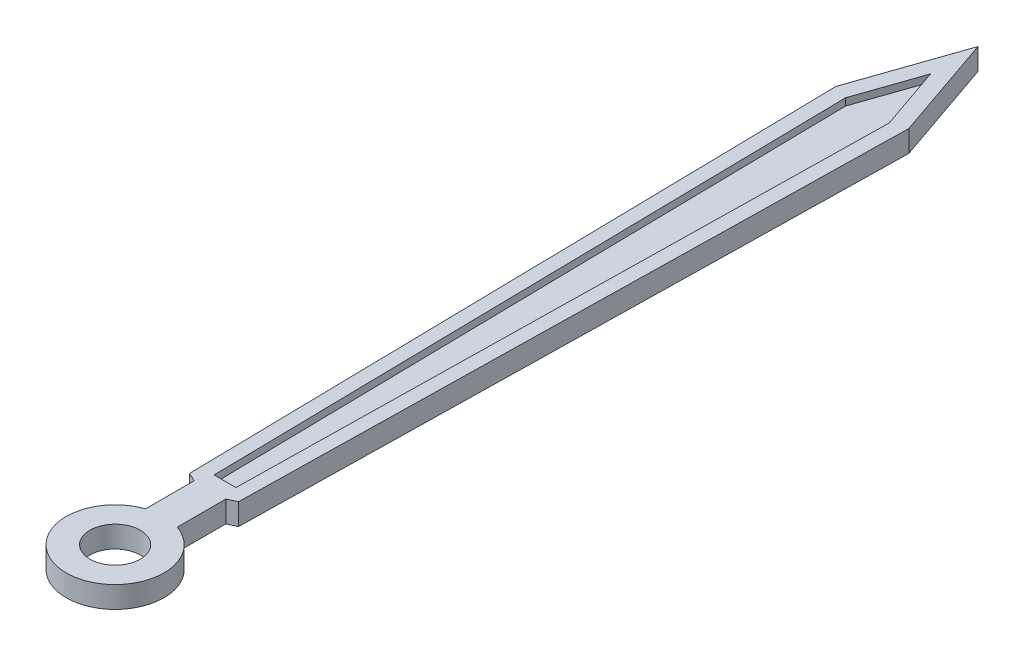
ISO-10303-21;
HEADER;
FILE_DESCRIPTION(('STEP AP214'),'2;1');
FILE_NAME('part.step','',(''),(''),'','','');
FILE_SCHEMA(('AUTOMOTIVE_DESIGN { 1 0 10303 214 1 1 1 1 }'));
ENDSEC;
DATA;
#1=APPLICATION_CONTEXT('core data for automotive mechanical design processes');
#2=APPLICATION_PROTOCOL_DEFINITION('international standard','automotive_design',2000,#1);
#3=PRODUCT_CONTEXT('',#1,'mechanical');
#4=PRODUCT('Part','Part','',(#3));
#5=PRODUCT_RELATED_PRODUCT_CATEGORY('part','',(#4));
#6=PRODUCT_DEFINITION_FORMATION('','',#4);
#7=PRODUCT_DEFINITION_CONTEXT('part definition',#1,'design');
#8=PRODUCT_DEFINITION('design','',#6,#7);
#9=PRODUCT_DEFINITION_SHAPE('','',#8);
#10=(LENGTH_UNIT() NAMED_UNIT(*) SI_UNIT(.MILLI.,.METRE.));
#11=(NAMED_UNIT(*) PLANE_ANGLE_UNIT() SI_UNIT($,.RADIAN.));
#12=(NAMED_UNIT(*) SI_UNIT($,.STERADIAN.) SOLID_ANGLE_UNIT());
#13=UNCERTAINTY_MEASURE_WITH_UNIT(LENGTH_MEASURE(1.E-05),#10,'distance_accuracy_value','');
#14=(GEOMETRIC_REPRESENTATION_CONTEXT(3) GLOBAL_UNCERTAINTY_ASSIGNED_CONTEXT((#13)) GLOBAL_UNIT_ASSIGNED_CONTEXT((#10,
#11,#12)) REPRESENTATION_CONTEXT('',''));
#15=CARTESIAN_POINT('',(0.,0.,0.));
#16=DIRECTION('',(0.,0.,1.));
#17=DIRECTION('',(1.,0.,0.));
#18=AXIS2_PLACEMENT_3D('',#15,#16,#17);
#19=CARTESIAN_POINT('',(0.,0.3,-12.));
#20=DIRECTION('',(-0.945291258367472,0.,0.326227584446873));
#21=DIRECTION('',(0.326227584446873,0.,0.945291258367472));
#22=AXIS2_PLACEMENT_3D('',#19,#20,#21);
#23=PLANE('',#22);
#24=DIRECTION('',(-0.326227584446873,0.,-0.945291258367472));
#25=VECTOR('',#24,1.);
#26=CARTESIAN_POINT('',(0.,0.,-12.));
#27=LINE('',#26,#25);
#28=CARTESIAN_POINT('',(0.507155701636799,0.,-10.5304435484775));
#29=VERTEX_POINT('',#28);
#30=CARTESIAN_POINT('',(0.,0.,-12.));
#31=VERTEX_POINT('',#30);
#32=EDGE_CURVE('E147',#29,#31,#27,.T.);
#33=ORIENTED_EDGE('',*,*,#32,.T.);
#34=DIRECTION('',(0.,-1.,0.));
#35=VECTOR('',#34,1.);
#36=CARTESIAN_POINT('',(0.,0.3,-12.));
#37=LINE('',#36,#35);
#38=CARTESIAN_POINT('',(0.,0.3,-12.));
#39=VERTEX_POINT('',#38);
#40=EDGE_CURVE('E11',#39,#31,#37,.T.);
#41=ORIENTED_EDGE('',*,*,#40,.F.);
#42=DIRECTION('',(-0.326227584446873,0.,-0.945291258367472));
#43=VECTOR('',#42,1.);
#44=CARTESIAN_POINT('',(0.,0.3,-12.));
#45=LINE('',#44,#43);
#46=CARTESIAN_POINT('',(0.507155701636799,0.3,-10.5304435484775));
#47=VERTEX_POINT('',#46);
#48=EDGE_CURVE('E165',#47,#39,#45,.T.);
#49=ORIENTED_EDGE('',*,*,#48,.F.);
#50=DIRECTION('',(0.,-1.,0.));
#51=VECTOR('',#50,1.);
#52=CARTESIAN_POINT('',(0.507155701636799,0.3,-10.5304435484775));
#53=LINE('',#52,#51);
#54=EDGE_CURVE('E143',#47,#29,#53,.T.);
#55=ORIENTED_EDGE('',*,*,#54,.T.);
#56=EDGE_LOOP('',(#33,#41,#49,#55));
#57=FACE_BOUND('',#56,.T.);
#58=ADVANCED_FACE('F33',(#57),#23,.F.);
#59=CARTESIAN_POINT('',(-0.507155701636799,0.3,-10.5304435484775));
#60=DIRECTION('',(0.945291258367472,0.,0.326227584446873));
#61=DIRECTION('',(0.326227584446873,0.,-0.945291258367472));
#62=AXIS2_PLACEMENT_3D('',#59,#60,#61);
#63=PLANE('',#62);
#64=DIRECTION('',(-0.326227584446873,0.,0.945291258367472));
#65=VECTOR('',#64,1.);
#66=CARTESIAN_POINT('',(-0.507155701636799,0.,-10.5304435484775));
#67=LINE('',#66,#65);
#68=CARTESIAN_POINT('',(-0.507155701636799,0.,-10.5304435484775));
#69=VERTEX_POINT('',#68);
#70=EDGE_CURVE('E150',#31,#69,#67,.T.);
#71=ORIENTED_EDGE('',*,*,#70,.T.);
#72=DIRECTION('',(0.,-1.,0.));
#73=VECTOR('',#72,1.);
#74=CARTESIAN_POINT('',(-0.507155701636799,0.3,-10.5304435484775));
#75=LINE('',#74,#73);
#76=CARTESIAN_POINT('',(-0.507155701636799,0.3,-10.5304435484775));
#77=VERTEX_POINT('',#76);
#78=EDGE_CURVE('E40',#77,#69,#75,.T.);
#79=ORIENTED_EDGE('',*,*,#78,.F.);
#80=DIRECTION('',(-0.326227584446873,0.,0.945291258367472));
#81=VECTOR('',#80,1.);
#82=CARTESIAN_POINT('',(-0.507155701636799,0.3,-10.5304435484775));
#83=LINE('',#82,#81);
#84=EDGE_CURVE('E100',#39,#77,#83,.T.);
#85=ORIENTED_EDGE('',*,*,#84,.F.);
#86=ORIENTED_EDGE('',*,*,#40,.T.);
#87=EDGE_LOOP('',(#71,#79,#85,#86));
#88=FACE_BOUND('',#87,.T.);
#89=ADVANCED_FACE('F300',(#88),#63,.F.);
#90=CARTESIAN_POINT('',(-0.507155701636799,0.3,-10.5304435484775));
#91=DIRECTION('',(0.999834746000162,0.,-0.0181791278886145));
#92=DIRECTION('',(-0.0181791278886146,0.,-0.999834746000163));
#93=AXIS2_PLACEMENT_3D('',#90,#91,#92);
#94=PLANE('',#93);
#95=DIRECTION('',(0.0181791278886146,0.,0.999834746000162));
#96=VECTOR('',#95,1.);
#97=CARTESIAN_POINT('',(-0.507155701636799,0.,-10.5304435484775));
#98=LINE('',#97,#96);
#99=CARTESIAN_POINT('',(-0.340695279600335,0.,-1.37527863596579));
#100=VERTEX_POINT('',#99);
#101=EDGE_CURVE('E153',#69,#100,#98,.T.);
#102=ORIENTED_EDGE('',*,*,#101,.T.);
#103=DIRECTION('',(0.,-1.,0.));
#104=VECTOR('',#103,1.);
#105=CARTESIAN_POINT('',(-0.340695279600335,0.3,-1.37527863596579));
#106=LINE('',#105,#104);
#107=CARTESIAN_POINT('',(-0.340695279600335,0.3,-1.37527863596579));
#108=VERTEX_POINT('',#107);
#109=EDGE_CURVE('E175',#108,#100,#106,.T.);
#110=ORIENTED_EDGE('',*,*,#109,.F.);
#111=DIRECTION('',(0.0181791278886146,0.,0.999834746000162));
#112=VECTOR('',#111,1.);
#113=CARTESIAN_POINT('',(-0.507155701636799,0.3,-10.5304435484775));
#114=LINE('',#113,#112);
#115=EDGE_CURVE('E183',#77,#108,#114,.T.);
#116=ORIENTED_EDGE('',*,*,#115,.F.);
#117=ORIENTED_EDGE('',*,*,#78,.T.);
#118=EDGE_LOOP('',(#102,#110,#116,#117));
#119=FACE_BOUND('',#118,.T.);
#120=ADVANCED_FACE('F181',(#119),#94,.F.);
#121=CARTESIAN_POINT('',(-0.340695279600335,0.3,-1.37527863596579));
#122=DIRECTION('',(0.419058177461745,0.,-0.907959384500452));
#123=DIRECTION('',(-0.907959384500453,0.,-0.419058177461746));
#124=AXIS2_PLACEMENT_3D('',#121,#122,#123);
#125=PLANE('',#124);
#126=DIRECTION('',(0.907959384500452,0.,0.419058177461745));
#127=VECTOR('',#126,1.);
#128=CARTESIAN_POINT('',(-0.340695279600335,0.,-1.37527863596579));
#129=LINE('',#128,#127);
#130=CARTESIAN_POINT('',(-0.220137797393776,0.,-1.31963672110122));
#131=VERTEX_POINT('',#130);
#132=EDGE_CURVE('E155',#100,#131,#129,.T.);
#133=ORIENTED_EDGE('',*,*,#132,.T.);
#134=DIRECTION('',(0.,-1.,0.));
#135=VECTOR('',#134,1.);
#136=CARTESIAN_POINT('',(-0.220137797393776,0.3,-1.31963672110122));
#137=LINE('',#136,#135);
#138=CARTESIAN_POINT('',(-0.220137797393776,0.3,-1.31963672110122));
#139=VERTEX_POINT('',#138);
#140=EDGE_CURVE('E172',#139,#131,#137,.T.);
#141=ORIENTED_EDGE('',*,*,#140,.F.);
#142=DIRECTION('',(0.907959384500452,0.,0.419058177461745));
#143=VECTOR('',#142,1.);
#144=CARTESIAN_POINT('',(-0.340695279600335,0.3,-1.37527863596579));
#145=LINE('',#144,#143);
#146=EDGE_CURVE('E199',#108,#139,#145,.T.);
#147=ORIENTED_EDGE('',*,*,#146,.F.);
#148=ORIENTED_EDGE('',*,*,#109,.T.);
#149=EDGE_LOOP('',(#133,#141,#147,#148));
#150=FACE_BOUND('',#149,.T.);
#151=ADVANCED_FACE('F192',(#150),#125,.F.);
#152=CARTESIAN_POINT('',(-0.220137797393776,0.3,-1.31963672110122));
#153=DIRECTION('',(1.,0.,0.));
#154=DIRECTION('',(0.,0.,-1.));
#155=AXIS2_PLACEMENT_3D('',#152,#153,#154);
#156=PLANE('',#155);
#157=DIRECTION('',(0.,0.,1.));
#158=VECTOR('',#157,1.);
#159=CARTESIAN_POINT('',(-0.220137797393776,0.,-1.31963672110122));
#160=LINE('',#159,#158);
#161=CARTESIAN_POINT('',(-0.220137797393776,0.,-0.643381185735655));
#162=VERTEX_POINT('',#161);
#163=EDGE_CURVE('E157',#131,#162,#160,.T.);
#164=ORIENTED_EDGE('',*,*,#163,.T.);
#165=DIRECTION('',(0.,-1.,0.));
#166=VECTOR('',#165,1.);
#167=CARTESIAN_POINT('',(-0.220137797393776,0.3,-0.643381185735655));
#168=LINE('',#167,#166);
#169=CARTESIAN_POINT('',(-0.220137797393776,0.3,-0.643381185735655));
#170=VERTEX_POINT('',#169);
#171=EDGE_CURVE('E169',#170,#162,#168,.T.);
#172=ORIENTED_EDGE('',*,*,#171,.F.);
#173=DIRECTION('',(0.,0.,1.));
#174=VECTOR('',#173,1.);
#175=CARTESIAN_POINT('',(-0.220137797393776,0.3,-1.31963672110122));
#176=LINE('',#175,#174);
#177=EDGE_CURVE('E198',#139,#170,#176,.T.);
#178=ORIENTED_EDGE('',*,*,#177,.F.);
#179=ORIENTED_EDGE('',*,*,#140,.T.);
#180=EDGE_LOOP('',(#164,#172,#178,#179));
#181=FACE_BOUND('',#180,.T.);
#182=ADVANCED_FACE('F196',(#181),#156,.F.);
#183=CARTESIAN_POINT('',(0.,0.3,0.));
#184=DIRECTION('',(0.,-1.,0.));
#185=DIRECTION('',(0.,0.,-1.));
#186=AXIS2_PLACEMENT_3D('',#183,#184,#185);
#187=CYLINDRICAL_SURFACE('',#186,0.68);
#188=CARTESIAN_POINT('',(0.,0.,0.));
#189=DIRECTION('',(0.,1.,0.));
#190=DIRECTION('',(0.,0.,-1.));
#191=AXIS2_PLACEMENT_3D('',#188,#189,#190);
#192=CIRCLE('',#191,0.68);
#193=CARTESIAN_POINT('',(0.220137797393776,0.,-0.643381185735655));
#194=VERTEX_POINT('',#193);
#195=EDGE_CURVE('E159',#162,#194,#192,.T.);
#196=ORIENTED_EDGE('',*,*,#195,.T.);
#197=DIRECTION('',(0.,-1.,0.));
#198=VECTOR('',#197,1.);
#199=CARTESIAN_POINT('',(0.220137797393776,0.3,-0.643381185735655));
#200=LINE('',#199,#198);
#201=CARTESIAN_POINT('',(0.220137797393776,0.3,-0.643381185735655));
#202=VERTEX_POINT('',#201);
#203=EDGE_CURVE('E138',#202,#194,#200,.T.);
#204=ORIENTED_EDGE('',*,*,#203,.F.);
#205=CARTESIAN_POINT('',(0.,0.3,0.));
#206=DIRECTION('',(0.,1.,0.));
#207=DIRECTION('',(0.,0.,-1.));
#208=AXIS2_PLACEMENT_3D('',#205,#206,#207);
#209=CIRCLE('',#208,0.68);
#210=EDGE_CURVE('E126',#170,#202,#209,.T.);
#211=ORIENTED_EDGE('',*,*,#210,.F.);
#212=ORIENTED_EDGE('',*,*,#171,.T.);
#213=EDGE_LOOP('',(#196,#204,#211,#212));
#214=FACE_BOUND('',#213,.T.);
#215=ADVANCED_FACE('F320',(#214),#187,.T.);
#216=CARTESIAN_POINT('',(0.220137797393776,0.3,-0.643381185735655));
#217=DIRECTION('',(-1.,0.,0.));
#218=DIRECTION('',(0.,0.,1.));
#219=AXIS2_PLACEMENT_3D('',#216,#217,#218);
#220=PLANE('',#219);
#221=DIRECTION('',(0.,0.,-1.));
#222=VECTOR('',#221,1.);
#223=CARTESIAN_POINT('',(0.220137797393776,0.,-0.643381185735655));
#224=LINE('',#223,#222);
#225=CARTESIAN_POINT('',(0.220137797393776,0.,-1.31963672110122));
#226=VERTEX_POINT('',#225);
#227=EDGE_CURVE('E135',#194,#226,#224,.T.);
#228=ORIENTED_EDGE('',*,*,#227,.T.);
#229=DIRECTION('',(0.,-1.,0.));
#230=VECTOR('',#229,1.);
#231=CARTESIAN_POINT('',(0.220137797393776,0.3,-1.31963672110122));
#232=LINE('',#231,#230);
#233=CARTESIAN_POINT('',(0.220137797393776,0.3,-1.31963672110122));
#234=VERTEX_POINT('',#233);
#235=EDGE_CURVE('E132',#234,#226,#232,.T.);
#236=ORIENTED_EDGE('',*,*,#235,.F.);
#237=DIRECTION('',(0.,0.,-1.));
#238=VECTOR('',#237,1.);
#239=CARTESIAN_POINT('',(0.220137797393776,0.3,-0.643381185735655));
#240=LINE('',#239,#238);
#241=EDGE_CURVE('E119',#202,#234,#240,.T.);
#242=ORIENTED_EDGE('',*,*,#241,.F.);
#243=ORIENTED_EDGE('',*,*,#203,.T.);
#244=EDGE_LOOP('',(#228,#236,#242,#243));
#245=FACE_BOUND('',#244,.T.);
#246=ADVANCED_FACE('F133',(#245),#220,.F.);
#247=CARTESIAN_POINT('',(0.340695279600335,0.3,-1.37527863596579));
#248=DIRECTION('',(-0.419058177461745,0.,-0.907959384500452));
#249=DIRECTION('',(-0.907959384500453,0.,0.419058177461746));
#250=AXIS2_PLACEMENT_3D('',#247,#248,#249);
#251=PLANE('',#250);
#252=DIRECTION('',(0.907959384500452,0.,-0.419058177461745));
#253=VECTOR('',#252,1.);
#254=CARTESIAN_POINT('',(0.340695279600335,0.,-1.37527863596579));
#255=LINE('',#254,#253);
#256=CARTESIAN_POINT('',(0.340695279600335,0.,-1.37527863596579));
#257=VERTEX_POINT('',#256);
#258=EDGE_CURVE('E162',#226,#257,#255,.T.);
#259=ORIENTED_EDGE('',*,*,#258,.T.);
#260=DIRECTION('',(0.,-1.,0.));
#261=VECTOR('',#260,1.);
#262=CARTESIAN_POINT('',(0.340695279600335,0.3,-1.37527863596579));
#263=LINE('',#262,#261);
#264=CARTESIAN_POINT('',(0.340695279600335,0.3,-1.37527863596579));
#265=VERTEX_POINT('',#264);
#266=EDGE_CURVE('E139',#265,#257,#263,.T.);
#267=ORIENTED_EDGE('',*,*,#266,.F.);
#268=DIRECTION('',(0.907959384500452,0.,-0.419058177461745));
#269=VECTOR('',#268,1.);
#270=CARTESIAN_POINT('',(0.340695279600335,0.3,-1.37527863596579));
#271=LINE('',#270,#269);
#272=EDGE_CURVE('E123',#234,#265,#271,.T.);
#273=ORIENTED_EDGE('',*,*,#272,.F.);
#274=ORIENTED_EDGE('',*,*,#235,.T.);
#275=EDGE_LOOP('',(#259,#267,#273,#274));
#276=FACE_BOUND('',#275,.T.);
#277=ADVANCED_FACE('F141',(#276),#251,.F.);
#278=CARTESIAN_POINT('',(0.507155701636799,0.3,-10.5304435484775));
#279=DIRECTION('',(-0.999834746000162,0.,-0.0181791278886145));
#280=DIRECTION('',(-0.0181791278886146,0.,0.999834746000163));
#281=AXIS2_PLACEMENT_3D('',#278,#279,#280);
#282=PLANE('',#281);
#283=DIRECTION('',(0.0181791278886146,0.,-0.999834746000162));
#284=VECTOR('',#283,1.);
#285=CARTESIAN_POINT('',(0.507155701636799,0.,-10.5304435484775));
#286=LINE('',#285,#284);
#287=EDGE_CURVE('E92',#257,#29,#286,.T.);
#288=ORIENTED_EDGE('',*,*,#287,.T.);
#289=ORIENTED_EDGE('',*,*,#54,.F.);
#290=DIRECTION('',(0.0181791278886146,0.,-0.999834746000162));
#291=VECTOR('',#290,1.);
#292=CARTESIAN_POINT('',(0.507155701636799,0.3,-10.5304435484775));
#293=LINE('',#292,#291);
#294=EDGE_CURVE('E56',#265,#47,#293,.T.);
#295=ORIENTED_EDGE('',*,*,#294,.F.);
#296=ORIENTED_EDGE('',*,*,#266,.T.);
#297=EDGE_LOOP('',(#288,#289,#295,#296));
#298=FACE_BOUND('',#297,.T.);
#299=ADVANCED_FACE('F307',(#298),#282,.F.);
#300=CARTESIAN_POINT('',(0.,0.3,0.));
#301=DIRECTION('',(0.,-1.,0.));
#302=DIRECTION('',(0.,0.,-1.));
#303=AXIS2_PLACEMENT_3D('',#300,#301,#302);
#304=PLANE('',#303);
#305=DIRECTION('',(0.0170079435781802,0.,0.999855354466456));
#306=VECTOR('',#305,1.);
#307=CARTESIAN_POINT('',(-0.303891547001217,0.3,-10.4602954606957));
#308=LINE('',#307,#306);
#309=CARTESIAN_POINT('',(-0.303891547001217,0.3,-10.4602954606957));
#310=VERTEX_POINT('',#309);
#311=CARTESIAN_POINT('',(-0.151945773500608,0.3,-1.52777551642469));
#312=VERTEX_POINT('',#311);
#313=EDGE_CURVE('E235',#310,#312,#308,.T.);
#314=ORIENTED_EDGE('',*,*,#313,.F.);
#315=DIRECTION('',(-0.326227584446873,0.,0.945291258367472));
#316=VECTOR('',#315,1.);
#317=CARTESIAN_POINT('',(0.,0.3,-11.3408648440575));
#318=LINE('',#317,#316);
#319=CARTESIAN_POINT('',(0.,0.3,-11.3408648440575));
#320=VERTEX_POINT('',#319);
#321=EDGE_CURVE('E47',#320,#310,#318,.T.);
#322=ORIENTED_EDGE('',*,*,#321,.F.);
#323=DIRECTION('',(-0.326227584446873,0.,-0.945291258367472));
#324=VECTOR('',#323,1.);
#325=CARTESIAN_POINT('',(0.,0.3,-11.3408648440575));
#326=LINE('',#325,#324);
#327=CARTESIAN_POINT('',(0.303891547001217,0.3,-10.4602954606957));
#328=VERTEX_POINT('',#327);
#329=EDGE_CURVE('E225',#328,#320,#326,.T.);
#330=ORIENTED_EDGE('',*,*,#329,.F.);
#331=DIRECTION('',(0.0170079435781802,0.,-0.999855354466456));
#332=VECTOR('',#331,1.);
#333=CARTESIAN_POINT('',(0.303891547001217,0.3,-10.4602954606957));
#334=LINE('',#333,#332);
#335=CARTESIAN_POINT('',(0.151945773500608,0.3,-1.52777551642469));
#336=VERTEX_POINT('',#335);
#337=EDGE_CURVE('E229',#336,#328,#334,.T.);
#338=ORIENTED_EDGE('',*,*,#337,.F.);
#339=DIRECTION('',(1.,0.,0.));
#340=VECTOR('',#339,1.);
#341=CARTESIAN_POINT('',(0.151945773500608,0.3,-1.52777551642469));
#342=LINE('',#341,#340);
#343=EDGE_CURVE('E232',#312,#336,#342,.T.);
#344=ORIENTED_EDGE('',*,*,#343,.F.);
#345=EDGE_LOOP('',(#314,#322,#330,#338,#344));
#346=FACE_BOUND('',#345,.T.);
#347=CARTESIAN_POINT('',(0.,0.3,0.));
#348=DIRECTION('',(0.,1.,0.));
#349=DIRECTION('',(0.,0.,1.));
#350=AXIS2_PLACEMENT_3D('',#347,#348,#349);
#351=CIRCLE('',#350,0.35);
#352=CARTESIAN_POINT('',(0.,0.3,0.35));
#353=VERTEX_POINT('',#352);
#354=EDGE_CURVE('E206',#353,#353,#351,.T.);
#355=ORIENTED_EDGE('',*,*,#354,.F.);
#356=EDGE_LOOP('',(#355));
#357=FACE_BOUND('',#356,.T.);
#358=ORIENTED_EDGE('',*,*,#48,.T.);
#359=ORIENTED_EDGE('',*,*,#84,.T.);
#360=ORIENTED_EDGE('',*,*,#115,.T.);
#361=ORIENTED_EDGE('',*,*,#146,.T.);
#362=ORIENTED_EDGE('',*,*,#177,.T.);
#363=ORIENTED_EDGE('',*,*,#210,.T.);
#364=ORIENTED_EDGE('',*,*,#241,.T.);
#365=ORIENTED_EDGE('',*,*,#272,.T.);
#366=ORIENTED_EDGE('',*,*,#294,.T.);
#367=EDGE_LOOP('',(#358,#359,#360,#361,#362,#363,#364,#365,#366));
#368=FACE_BOUND('',#367,.T.);
#369=ADVANCED_FACE('F121',(#346,#357,#368),#304,.F.);
#370=CARTESIAN_POINT('',(0.,0.,0.));
#371=DIRECTION('',(0.,-1.,0.));
#372=DIRECTION('',(0.,0.,-1.));
#373=AXIS2_PLACEMENT_3D('',#370,#371,#372);
#374=PLANE('',#373);
#375=CARTESIAN_POINT('',(0.,0.,0.));
#376=DIRECTION('',(0.,1.,0.));
#377=DIRECTION('',(0.,0.,1.));
#378=AXIS2_PLACEMENT_3D('',#375,#376,#377);
#379=CIRCLE('',#378,0.35);
#380=CARTESIAN_POINT('',(0.,0.,0.35));
#381=VERTEX_POINT('',#380);
#382=EDGE_CURVE('E151',#381,#381,#379,.T.);
#383=ORIENTED_EDGE('',*,*,#382,.T.);
#384=EDGE_LOOP('',(#383));
#385=FACE_BOUND('',#384,.T.);
#386=ORIENTED_EDGE('',*,*,#32,.F.);
#387=ORIENTED_EDGE('',*,*,#287,.F.);
#388=ORIENTED_EDGE('',*,*,#258,.F.);
#389=ORIENTED_EDGE('',*,*,#227,.F.);
#390=ORIENTED_EDGE('',*,*,#195,.F.);
#391=ORIENTED_EDGE('',*,*,#163,.F.);
#392=ORIENTED_EDGE('',*,*,#132,.F.);
#393=ORIENTED_EDGE('',*,*,#101,.F.);
#394=ORIENTED_EDGE('',*,*,#70,.F.);
#395=EDGE_LOOP('',(#386,#387,#388,#389,#390,#391,#392,#393,#394));
#396=FACE_BOUND('',#395,.T.);
#397=ADVANCED_FACE('F187',(#385,#396),#374,.T.);
#398=CARTESIAN_POINT('',(0.,0.,0.));
#399=DIRECTION('',(0.,1.,0.));
#400=DIRECTION('',(0.,0.,1.));
#401=AXIS2_PLACEMENT_3D('',#398,#399,#400);
#402=CYLINDRICAL_SURFACE('',#401,0.35);
#403=ORIENTED_EDGE('',*,*,#382,.F.);
#404=EDGE_LOOP('',(#403));
#405=FACE_BOUND('',#404,.T.);
#406=ORIENTED_EDGE('',*,*,#354,.T.);
#407=EDGE_LOOP('',(#406));
#408=FACE_BOUND('',#407,.T.);
#409=ADVANCED_FACE('F367',(#405,#408),#402,.F.);
#410=CARTESIAN_POINT('',(0.,0.2,-11.3408648440575));
#411=DIRECTION('',(-0.945291258367472,0.,-0.326227584446873));
#412=DIRECTION('',(-0.326227584446873,0.,0.945291258367472));
#413=AXIS2_PLACEMENT_3D('',#410,#411,#412);
#414=PLANE('',#413);
#415=ORIENTED_EDGE('',*,*,#321,.T.);
#416=DIRECTION('',(0.,1.,0.));
#417=VECTOR('',#416,1.);
#418=CARTESIAN_POINT('',(-0.303891547001217,0.2,-10.4602954606957));
#419=LINE('',#418,#417);
#420=CARTESIAN_POINT('',(-0.303891547001217,0.2,-10.4602954606957));
#421=VERTEX_POINT('',#420);
#422=EDGE_CURVE('E212',#421,#310,#419,.T.);
#423=ORIENTED_EDGE('',*,*,#422,.F.);
#424=DIRECTION('',(-0.326227584446873,0.,0.945291258367472));
#425=VECTOR('',#424,1.);
#426=CARTESIAN_POINT('',(0.,0.2,-11.3408648440575));
#427=LINE('',#426,#425);
#428=CARTESIAN_POINT('',(0.,0.2,-11.3408648440575));
#429=VERTEX_POINT('',#428);
#430=EDGE_CURVE('E228',#429,#421,#427,.T.);
#431=ORIENTED_EDGE('',*,*,#430,.F.);
#432=DIRECTION('',(0.,1.,0.));
#433=VECTOR('',#432,1.);
#434=CARTESIAN_POINT('',(0.,0.2,-11.3408648440575));
#435=LINE('',#434,#433);
#436=EDGE_CURVE('E209',#429,#320,#435,.T.);
#437=ORIENTED_EDGE('',*,*,#436,.T.);
#438=EDGE_LOOP('',(#415,#423,#431,#437));
#439=FACE_BOUND('',#438,.T.);
#440=ADVANCED_FACE('F259',(#439),#414,.F.);
#441=CARTESIAN_POINT('',(0.,0.2,-11.3408648440575));
#442=DIRECTION('',(0.945291258367472,0.,-0.326227584446873));
#443=DIRECTION('',(-0.326227584446873,0.,-0.945291258367472));
#444=AXIS2_PLACEMENT_3D('',#441,#442,#443);
#445=PLANE('',#444);
#446=ORIENTED_EDGE('',*,*,#329,.T.);
#447=ORIENTED_EDGE('',*,*,#436,.F.);
#448=DIRECTION('',(-0.326227584446873,0.,-0.945291258367472));
#449=VECTOR('',#448,1.);
#450=CARTESIAN_POINT('',(0.,0.2,-11.3408648440575));
#451=LINE('',#450,#449);
#452=CARTESIAN_POINT('',(0.303891547001217,0.2,-10.4602954606957));
#453=VERTEX_POINT('',#452);
#454=EDGE_CURVE('E215',#453,#429,#451,.T.);
#455=ORIENTED_EDGE('',*,*,#454,.F.);
#456=DIRECTION('',(0.,1.,0.));
#457=VECTOR('',#456,1.);
#458=CARTESIAN_POINT('',(0.303891547001217,0.2,-10.4602954606957));
#459=LINE('',#458,#457);
#460=EDGE_CURVE('E221',#453,#328,#459,.T.);
#461=ORIENTED_EDGE('',*,*,#460,.T.);
#462=EDGE_LOOP('',(#446,#447,#455,#461));
#463=FACE_BOUND('',#462,.T.);
#464=ADVANCED_FACE('F273',(#463),#445,.F.);
#465=CARTESIAN_POINT('',(0.303891547001217,0.2,-10.4602954606957));
#466=DIRECTION('',(0.999855354466455,0.,0.0170079435781802));
#467=DIRECTION('',(0.0170079435781802,0.,-0.999855354466456));
#468=AXIS2_PLACEMENT_3D('',#465,#466,#467);
#469=PLANE('',#468);
#470=ORIENTED_EDGE('',*,*,#337,.T.);
#471=ORIENTED_EDGE('',*,*,#460,.F.);
#472=DIRECTION('',(0.0170079435781802,0.,-0.999855354466456));
#473=VECTOR('',#472,1.);
#474=CARTESIAN_POINT('',(0.303891547001217,0.2,-10.4602954606957));
#475=LINE('',#474,#473);
#476=CARTESIAN_POINT('',(0.151945773500608,0.2,-1.52777551642469));
#477=VERTEX_POINT('',#476);
#478=EDGE_CURVE('E241',#477,#453,#475,.T.);
#479=ORIENTED_EDGE('',*,*,#478,.F.);
#480=DIRECTION('',(0.,1.,0.));
#481=VECTOR('',#480,1.);
#482=CARTESIAN_POINT('',(0.151945773500608,0.2,-1.52777551642469));
#483=LINE('',#482,#481);
#484=EDGE_CURVE('E218',#477,#336,#483,.T.);
#485=ORIENTED_EDGE('',*,*,#484,.T.);
#486=EDGE_LOOP('',(#470,#471,#479,#485));
#487=FACE_BOUND('',#486,.T.);
#488=ADVANCED_FACE('F278',(#487),#469,.F.);
#489=CARTESIAN_POINT('',(0.151945773500608,0.2,-1.52777551642469));
#490=DIRECTION('',(0.,0.,1.));
#491=DIRECTION('',(1.,0.,0.));
#492=AXIS2_PLACEMENT_3D('',#489,#490,#491);
#493=PLANE('',#492);
#494=ORIENTED_EDGE('',*,*,#343,.T.);
#495=ORIENTED_EDGE('',*,*,#484,.F.);
#496=DIRECTION('',(1.,0.,0.));
#497=VECTOR('',#496,1.);
#498=CARTESIAN_POINT('',(0.151945773500608,0.2,-1.52777551642469));
#499=LINE('',#498,#497);
#500=CARTESIAN_POINT('',(-0.151945773500608,0.2,-1.52777551642469));
#501=VERTEX_POINT('',#500);
#502=EDGE_CURVE('E244',#501,#477,#499,.T.);
#503=ORIENTED_EDGE('',*,*,#502,.F.);
#504=DIRECTION('',(0.,1.,0.));
#505=VECTOR('',#504,1.);
#506=CARTESIAN_POINT('',(-0.151945773500608,0.2,-1.52777551642469));
#507=LINE('',#506,#505);
#508=EDGE_CURVE('E214',#501,#312,#507,.T.);
#509=ORIENTED_EDGE('',*,*,#508,.T.);
#510=EDGE_LOOP('',(#494,#495,#503,#509));
#511=FACE_BOUND('',#510,.T.);
#512=ADVANCED_FACE('F290',(#511),#493,.F.);
#513=CARTESIAN_POINT('',(-0.303891547001217,0.2,-10.4602954606957));
#514=DIRECTION('',(-0.999855354466455,0.,0.0170079435781802));
#515=DIRECTION('',(0.0170079435781802,0.,0.999855354466456));
#516=AXIS2_PLACEMENT_3D('',#513,#514,#515);
#517=PLANE('',#516);
#518=ORIENTED_EDGE('',*,*,#313,.T.);
#519=ORIENTED_EDGE('',*,*,#508,.F.);
#520=DIRECTION('',(0.0170079435781802,0.,0.999855354466456));
#521=VECTOR('',#520,1.);
#522=CARTESIAN_POINT('',(-0.303891547001217,0.2,-10.4602954606957));
#523=LINE('',#522,#521);
#524=EDGE_CURVE('E247',#421,#501,#523,.T.);
#525=ORIENTED_EDGE('',*,*,#524,.F.);
#526=ORIENTED_EDGE('',*,*,#422,.T.);
#527=EDGE_LOOP('',(#518,#519,#525,#526));
#528=FACE_BOUND('',#527,.T.);
#529=ADVANCED_FACE('F286',(#528),#517,.F.);
#530=CARTESIAN_POINT('',(0.,0.2,0.));
#531=DIRECTION('',(0.,-1.,0.));
#532=DIRECTION('',(0.,0.,-1.));
#533=AXIS2_PLACEMENT_3D('',#530,#531,#532);
#534=PLANE('',#533);
#535=ORIENTED_EDGE('',*,*,#430,.T.);
#536=ORIENTED_EDGE('',*,*,#524,.T.);
#537=ORIENTED_EDGE('',*,*,#502,.T.);
#538=ORIENTED_EDGE('',*,*,#478,.T.);
#539=ORIENTED_EDGE('',*,*,#454,.T.);
#540=EDGE_LOOP('',(#535,#536,#537,#538,#539));
#541=FACE_BOUND('',#540,.T.);
#542=ADVANCED_FACE('F254',(#541),#534,.F.);
#543=CLOSED_SHELL('',(#58,#89,#120,#151,#182,#215,#246,#277,#299,#369,#397,#409,#440,#464,#488,
#512,#529,#542));
#544=MANIFOLD_SOLID_BREP('B2',#543);
#545=ADVANCED_BREP_SHAPE_REPRESENTATION('',(#18,#544),#14);
#546=SHAPE_DEFINITION_REPRESENTATION(#9,#545);
ENDSEC;
END-ISO-10303-21;
